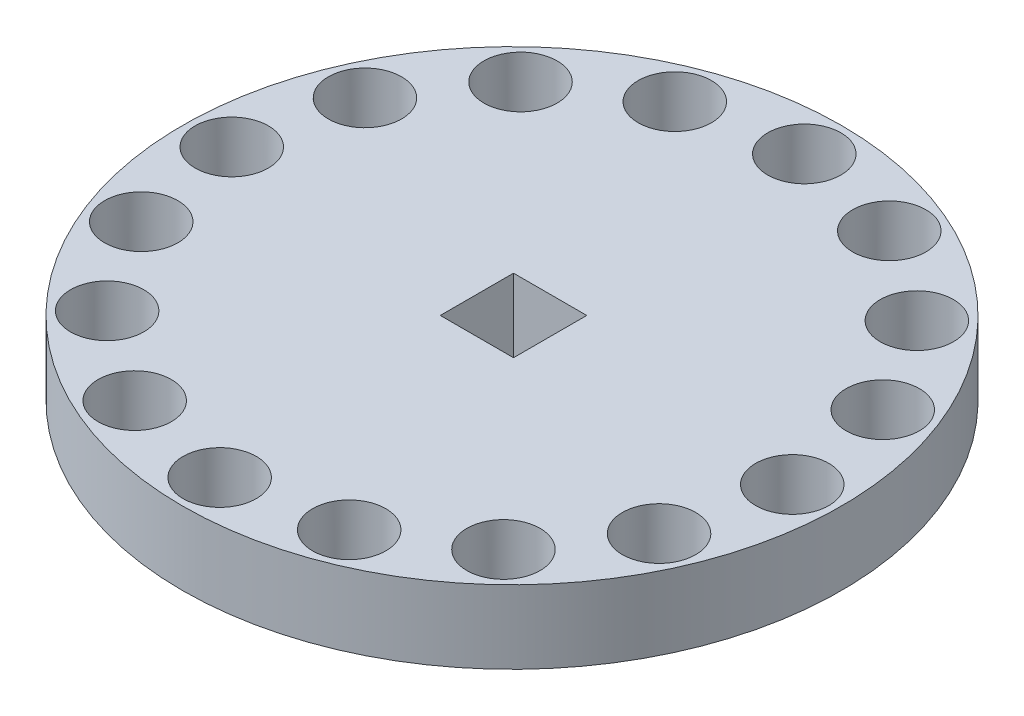
ISO-10303-21;
HEADER;
FILE_DESCRIPTION(('STEP AP214'),'2;1');
FILE_NAME('part.step','',(''),(''),'','','');
FILE_SCHEMA(('AUTOMOTIVE_DESIGN { 1 0 10303 214 1 1 1 1 }'));
ENDSEC;
DATA;
#1=APPLICATION_CONTEXT('core data for automotive mechanical design processes');
#2=APPLICATION_PROTOCOL_DEFINITION('international standard','automotive_design',2000,#1);
#3=PRODUCT_CONTEXT('',#1,'mechanical');
#4=PRODUCT('Part','Part','',(#3));
#5=PRODUCT_RELATED_PRODUCT_CATEGORY('part','',(#4));
#6=PRODUCT_DEFINITION_FORMATION('','',#4);
#7=PRODUCT_DEFINITION_CONTEXT('part definition',#1,'design');
#8=PRODUCT_DEFINITION('design','',#6,#7);
#9=PRODUCT_DEFINITION_SHAPE('','',#8);
#10=(LENGTH_UNIT() NAMED_UNIT(*) SI_UNIT(.MILLI.,.METRE.));
#11=(NAMED_UNIT(*) PLANE_ANGLE_UNIT() SI_UNIT($,.RADIAN.));
#12=(NAMED_UNIT(*) SI_UNIT($,.STERADIAN.) SOLID_ANGLE_UNIT());
#13=UNCERTAINTY_MEASURE_WITH_UNIT(LENGTH_MEASURE(1.E-05),#10,'distance_accuracy_value','');
#14=(GEOMETRIC_REPRESENTATION_CONTEXT(3) GLOBAL_UNCERTAINTY_ASSIGNED_CONTEXT((#13)) GLOBAL_UNIT_ASSIGNED_CONTEXT((#10,
#11,#12)) REPRESENTATION_CONTEXT('',''));
#15=CARTESIAN_POINT('',(0.,0.,0.));
#16=DIRECTION('',(0.,0.,1.));
#17=DIRECTION('',(1.,0.,0.));
#18=AXIS2_PLACEMENT_3D('',#15,#16,#17);
#19=CARTESIAN_POINT('',(0.,2.,0.));
#20=DIRECTION('',(0.,-1.,0.));
#21=DIRECTION('',(0.,0.,-1.));
#22=AXIS2_PLACEMENT_3D('',#19,#20,#21);
#23=CYLINDRICAL_SURFACE('',#22,9.);
#24=CARTESIAN_POINT('',(0.,2.,0.));
#25=DIRECTION('',(0.,1.,0.));
#26=DIRECTION('',(0.,0.,1.));
#27=AXIS2_PLACEMENT_3D('',#24,#25,#26);
#28=CIRCLE('',#27,9.);
#29=CARTESIAN_POINT('',(0.,2.,9.));
#30=VERTEX_POINT('',#29);
#31=EDGE_CURVE('E118',#30,#30,#28,.T.);
#32=ORIENTED_EDGE('',*,*,#31,.F.);
#33=EDGE_LOOP('',(#32));
#34=FACE_BOUND('',#33,.T.);
#35=CARTESIAN_POINT('',(0.,0.,0.));
#36=DIRECTION('',(0.,1.,0.));
#37=DIRECTION('',(0.,0.,1.));
#38=AXIS2_PLACEMENT_3D('',#35,#36,#37);
#39=CIRCLE('',#38,9.);
#40=CARTESIAN_POINT('',(0.,0.,9.));
#41=VERTEX_POINT('',#40);
#42=EDGE_CURVE('E113',#41,#41,#39,.T.);
#43=ORIENTED_EDGE('',*,*,#42,.T.);
#44=EDGE_LOOP('',(#43));
#45=FACE_BOUND('',#44,.T.);
#46=ADVANCED_FACE('F39',(#34,#45),#23,.T.);
#47=CARTESIAN_POINT('',(0.,2.,0.));
#48=DIRECTION('',(0.,1.,0.));
#49=DIRECTION('',(0.,0.,1.));
#50=AXIS2_PLACEMENT_3D('',#47,#48,#49);
#51=PLANE('',#50);
#52=CARTESIAN_POINT('',(5.41167169395816,2.,5.64458181266345));
#53=DIRECTION('',(0.,1.,0.));
#54=DIRECTION('',(-0.707106781186549,0.,0.707106781186546));
#55=AXIS2_PLACEMENT_3D('',#52,#53,#54);
#56=CIRCLE('',#55,1.);
#57=CARTESIAN_POINT('',(4.7045649127716,2.,6.35168859385));
#58=VERTEX_POINT('',#57);
#59=EDGE_CURVE('E209',#58,#58,#56,.T.);
#60=ORIENTED_EDGE('',*,*,#59,.F.);
#61=EDGE_LOOP('',(#60));
#62=FACE_BOUND('',#61,.T.);
#63=CARTESIAN_POINT('',(2.83964477238301,2.,7.28587070498213));
#64=DIRECTION('',(0.,1.,0.));
#65=DIRECTION('',(-0.923879532511288,0.,0.382683432365087));
#66=AXIS2_PLACEMENT_3D('',#63,#64,#65);
#67=CIRCLE('',#66,1.);
#68=CARTESIAN_POINT('',(1.91576523987172,2.,7.66855413734721));
#69=VERTEX_POINT('',#68);
#70=EDGE_CURVE('E235',#69,#69,#67,.T.);
#71=ORIENTED_EDGE('',*,*,#70,.F.);
#72=EDGE_LOOP('',(#71));
#73=FACE_BOUND('',#72,.T.);
#74=CARTESIAN_POINT('',(-0.16469232434349,2.,7.81795182904968));
#75=DIRECTION('',(0.,1.,0.));
#76=DIRECTION('',(-1.,0.,0.));
#77=AXIS2_PLACEMENT_3D('',#74,#75,#76);
#78=CIRCLE('',#77,1.);
#79=CARTESIAN_POINT('',(-1.16469232434349,2.,7.81795182904968));
#80=VERTEX_POINT('',#79);
#81=EDGE_CURVE('E231',#80,#80,#78,.T.);
#82=ORIENTED_EDGE('',*,*,#81,.F.);
#83=EDGE_LOOP('',(#82));
#84=FACE_BOUND('',#83,.T.);
#85=CARTESIAN_POINT('',(-3.14395650762833,2.,7.15982065705422));
#86=DIRECTION('',(0.,1.,0.));
#87=DIRECTION('',(-0.923879532511285,0.,-0.382683432365094));
#88=AXIS2_PLACEMENT_3D('',#85,#86,#87);
#89=CIRCLE('',#88,1.);
#90=CARTESIAN_POINT('',(-4.06783604013962,2.,6.77713722468913));
#91=VERTEX_POINT('',#90);
#92=EDGE_CURVE('E227',#91,#91,#89,.T.);
#93=ORIENTED_EDGE('',*,*,#92,.F.);
#94=EDGE_LOOP('',(#93));
#95=FACE_BOUND('',#94,.T.);
#96=CARTESIAN_POINT('',(-5.64458181266347,2.,5.41167169395813));
#97=DIRECTION('',(0.,1.,0.));
#98=DIRECTION('',(-0.707106781186544,0.,-0.707106781186551));
#99=AXIS2_PLACEMENT_3D('',#96,#97,#98);
#100=CIRCLE('',#99,1.);
#101=CARTESIAN_POINT('',(-6.35168859385001,2.,4.70456491277158));
#102=VERTEX_POINT('',#101);
#103=EDGE_CURVE('E223',#102,#102,#100,.T.);
#104=ORIENTED_EDGE('',*,*,#103,.F.);
#105=EDGE_LOOP('',(#104));
#106=FACE_BOUND('',#105,.T.);
#107=CARTESIAN_POINT('',(-7.28587070498213,2.,2.83964477238298));
#108=DIRECTION('',(0.,1.,0.));
#109=DIRECTION('',(-0.382683432365084,0.,-0.923879532511289));
#110=AXIS2_PLACEMENT_3D('',#107,#108,#109);
#111=CIRCLE('',#110,1.);
#112=CARTESIAN_POINT('',(-7.66855413734722,2.,1.91576523987169));
#113=VERTEX_POINT('',#112);
#114=EDGE_CURVE('E219',#113,#113,#111,.T.);
#115=ORIENTED_EDGE('',*,*,#114,.F.);
#116=EDGE_LOOP('',(#115));
#117=FACE_BOUND('',#116,.T.);
#118=CARTESIAN_POINT('',(-7.81795182904968,2.,-0.164692324343463));
#119=DIRECTION('',(0.,1.,0.));
#120=DIRECTION('',(0.,0.,-1.));
#121=AXIS2_PLACEMENT_3D('',#118,#119,#120);
#122=CIRCLE('',#121,1.);
#123=CARTESIAN_POINT('',(-7.81795182904968,2.,-1.16469232434346));
#124=VERTEX_POINT('',#123);
#125=EDGE_CURVE('E214',#124,#124,#122,.T.);
#126=ORIENTED_EDGE('',*,*,#125,.F.);
#127=EDGE_LOOP('',(#126));
#128=FACE_BOUND('',#127,.T.);
#129=CARTESIAN_POINT('',(-7.15982065705421,2.,-3.14395650762836));
#130=DIRECTION('',(0.,1.,0.));
#131=DIRECTION('',(0.382683432365097,0.,-0.923879532511284));
#132=AXIS2_PLACEMENT_3D('',#129,#130,#131);
#133=CIRCLE('',#132,1.);
#134=CARTESIAN_POINT('',(-6.77713722468911,2.,-4.06783604013964));
#135=VERTEX_POINT('',#134);
#136=EDGE_CURVE('E210',#135,#135,#133,.T.);
#137=ORIENTED_EDGE('',*,*,#136,.F.);
#138=EDGE_LOOP('',(#137));
#139=FACE_BOUND('',#138,.T.);
#140=CARTESIAN_POINT('',(-5.41167169395812,2.,-5.64458181266349));
#141=DIRECTION('',(0.,1.,0.));
#142=DIRECTION('',(0.707106781186554,0.,-0.707106781186541));
#143=AXIS2_PLACEMENT_3D('',#140,#141,#142);
#144=CIRCLE('',#143,1.);
#145=CARTESIAN_POINT('',(-4.70456491277156,2.,-6.35168859385003));
#146=VERTEX_POINT('',#145);
#147=EDGE_CURVE('E215',#146,#146,#144,.T.);
#148=ORIENTED_EDGE('',*,*,#147,.F.);
#149=EDGE_LOOP('',(#148));
#150=FACE_BOUND('',#149,.T.);
#151=CARTESIAN_POINT('',(-2.83964477238295,2.,-7.28587070498215));
#152=DIRECTION('',(0.,1.,0.));
#153=DIRECTION('',(0.923879532511291,0.,-0.382683432365081));
#154=AXIS2_PLACEMENT_3D('',#151,#152,#153);
#155=CIRCLE('',#154,1.);
#156=CARTESIAN_POINT('',(-1.91576523987166,2.,-7.66855413734723));
#157=VERTEX_POINT('',#156);
#158=EDGE_CURVE('E258',#157,#157,#155,.T.);
#159=ORIENTED_EDGE('',*,*,#158,.F.);
#160=EDGE_LOOP('',(#159));
#161=FACE_BOUND('',#160,.T.);
#162=CARTESIAN_POINT('',(0.164692324343545,2.,-7.81795182904968));
#163=DIRECTION('',(0.,1.,0.));
#164=DIRECTION('',(1.,0.,0.));
#165=AXIS2_PLACEMENT_3D('',#162,#163,#164);
#166=CIRCLE('',#165,1.);
#167=CARTESIAN_POINT('',(1.16469232434355,2.,-7.81795182904967));
#168=VERTEX_POINT('',#167);
#169=EDGE_CURVE('E254',#168,#168,#166,.T.);
#170=ORIENTED_EDGE('',*,*,#169,.F.);
#171=EDGE_LOOP('',(#170));
#172=FACE_BOUND('',#171,.T.);
#173=CARTESIAN_POINT('',(3.14395650762838,2.,-7.1598206570542));
#174=DIRECTION('',(0.,1.,0.));
#175=DIRECTION('',(0.923879532511283,0.,0.3826834323651));
#176=AXIS2_PLACEMENT_3D('',#173,#174,#175);
#177=CIRCLE('',#176,1.);
#178=CARTESIAN_POINT('',(4.06783604013966,2.,-6.7771372246891));
#179=VERTEX_POINT('',#178);
#180=EDGE_CURVE('E250',#179,#179,#177,.T.);
#181=ORIENTED_EDGE('',*,*,#180,.F.);
#182=EDGE_LOOP('',(#181));
#183=FACE_BOUND('',#182,.T.);
#184=CARTESIAN_POINT('',(5.6445818126635,2.,-5.4116716939581));
#185=DIRECTION('',(0.,1.,0.));
#186=DIRECTION('',(0.707106781186539,0.,0.707106781186556));
#187=AXIS2_PLACEMENT_3D('',#184,#185,#186);
#188=CIRCLE('',#187,1.);
#189=CARTESIAN_POINT('',(6.35168859385004,2.,-4.70456491277154));
#190=VERTEX_POINT('',#189);
#191=EDGE_CURVE('E246',#190,#190,#188,.T.);
#192=ORIENTED_EDGE('',*,*,#191,.F.);
#193=EDGE_LOOP('',(#192));
#194=FACE_BOUND('',#193,.T.);
#195=CARTESIAN_POINT('',(7.28587070498216,2.,-2.83964477238293));
#196=DIRECTION('',(0.,1.,0.));
#197=DIRECTION('',(0.382683432365077,0.,0.923879532511292));
#198=AXIS2_PLACEMENT_3D('',#195,#196,#197);
#199=CIRCLE('',#198,1.);
#200=CARTESIAN_POINT('',(7.66855413734723,2.,-1.91576523987164));
#201=VERTEX_POINT('',#200);
#202=EDGE_CURVE('E242',#201,#201,#199,.T.);
#203=ORIENTED_EDGE('',*,*,#202,.F.);
#204=EDGE_LOOP('',(#203));
#205=FACE_BOUND('',#204,.T.);
#206=CARTESIAN_POINT('',(7.15982065705423,2.,3.14395650762831));
#207=DIRECTION('',(0.,1.,0.));
#208=DIRECTION('',(-0.382683432365091,0.,0.923879532511287));
#209=AXIS2_PLACEMENT_3D('',#206,#207,#208);
#210=CIRCLE('',#209,1.);
#211=CARTESIAN_POINT('',(6.77713722468914,2.,4.06783604013959));
#212=VERTEX_POINT('',#211);
#213=EDGE_CURVE('E143',#212,#212,#210,.T.);
#214=ORIENTED_EDGE('',*,*,#213,.F.);
#215=EDGE_LOOP('',(#214));
#216=FACE_BOUND('',#215,.T.);
#217=CARTESIAN_POINT('',(7.81795182904968,2.,0.164692324343463));
#218=DIRECTION('',(0.,1.,0.));
#219=DIRECTION('',(0.,0.,1.));
#220=AXIS2_PLACEMENT_3D('',#217,#218,#219);
#221=CIRCLE('',#220,1.);
#222=CARTESIAN_POINT('',(7.81795182904968,2.,1.16469232434346));
#223=VERTEX_POINT('',#222);
#224=EDGE_CURVE('E137',#223,#223,#221,.T.);
#225=ORIENTED_EDGE('',*,*,#224,.F.);
#226=EDGE_LOOP('',(#225));
#227=FACE_BOUND('',#226,.T.);
#228=DIRECTION('',(0.,0.,-1.));
#229=VECTOR('',#228,1.);
#230=CARTESIAN_POINT('',(1.01420565881301,2.,-1.02735749943532));
#231=LINE('',#230,#229);
#232=CARTESIAN_POINT('',(1.01420565881301,2.,0.972642500564676));
#233=VERTEX_POINT('',#232);
#234=CARTESIAN_POINT('',(1.01420565881301,2.,-1.02735749943532));
#235=VERTEX_POINT('',#234);
#236=EDGE_CURVE('E56',#233,#235,#231,.T.);
#237=ORIENTED_EDGE('',*,*,#236,.F.);
#238=DIRECTION('',(1.,0.,0.));
#239=VECTOR('',#238,1.);
#240=CARTESIAN_POINT('',(1.01420565881301,2.,0.972642500564676));
#241=LINE('',#240,#239);
#242=CARTESIAN_POINT('',(-0.985794341186992,2.,0.972642500564676));
#243=VERTEX_POINT('',#242);
#244=EDGE_CURVE('E103',#243,#233,#241,.T.);
#245=ORIENTED_EDGE('',*,*,#244,.F.);
#246=DIRECTION('',(0.,0.,1.));
#247=VECTOR('',#246,1.);
#248=CARTESIAN_POINT('',(-0.985794341186995,2.,-1.02735749943532));
#249=LINE('',#248,#247);
#250=CARTESIAN_POINT('',(-0.985794341186995,2.,-1.02735749943532));
#251=VERTEX_POINT('',#250);
#252=EDGE_CURVE('E85',#251,#243,#249,.T.);
#253=ORIENTED_EDGE('',*,*,#252,.F.);
#254=DIRECTION('',(-1.,0.,0.));
#255=VECTOR('',#254,1.);
#256=CARTESIAN_POINT('',(1.01420565881301,2.,-1.02735749943532));
#257=LINE('',#256,#255);
#258=EDGE_CURVE('E95',#235,#251,#257,.T.);
#259=ORIENTED_EDGE('',*,*,#258,.F.);
#260=EDGE_LOOP('',(#237,#245,#253,#259));
#261=FACE_BOUND('',#260,.T.);
#262=ORIENTED_EDGE('',*,*,#31,.T.);
#263=EDGE_LOOP('',(#262));
#264=FACE_BOUND('',#263,.T.);
#265=ADVANCED_FACE('F100',(#62,#73,#84,#95,#106,#117,#128,#139,#150,#161,#172,#183,#194,#205,
#216,#227,#261,#264),#51,.T.);
#266=CARTESIAN_POINT('',(0.,0.,0.));
#267=DIRECTION('',(0.,1.,0.));
#268=DIRECTION('',(0.,0.,1.));
#269=AXIS2_PLACEMENT_3D('',#266,#267,#268);
#270=PLANE('',#269);
#271=CARTESIAN_POINT('',(5.41167169395816,0.,5.64458181266345));
#272=DIRECTION('',(0.,1.,0.));
#273=DIRECTION('',(0.,0.,1.));
#274=AXIS2_PLACEMENT_3D('',#271,#272,#273);
#275=CIRCLE('',#274,1.);
#276=CARTESIAN_POINT('',(5.41167169395816,0.,6.64458181266345));
#277=VERTEX_POINT('',#276);
#278=EDGE_CURVE('E42',#277,#277,#275,.T.);
#279=ORIENTED_EDGE('',*,*,#278,.T.);
#280=EDGE_LOOP('',(#279));
#281=FACE_BOUND('',#280,.T.);
#282=CARTESIAN_POINT('',(2.83964477238301,0.,7.28587070498213));
#283=DIRECTION('',(0.,1.,0.));
#284=DIRECTION('',(0.,0.,1.));
#285=AXIS2_PLACEMENT_3D('',#282,#283,#284);
#286=CIRCLE('',#285,1.);
#287=CARTESIAN_POINT('',(2.83964477238301,0.,8.28587070498213));
#288=VERTEX_POINT('',#287);
#289=EDGE_CURVE('E190',#288,#288,#286,.T.);
#290=ORIENTED_EDGE('',*,*,#289,.T.);
#291=EDGE_LOOP('',(#290));
#292=FACE_BOUND('',#291,.T.);
#293=CARTESIAN_POINT('',(-0.16469232434349,0.,7.81795182904968));
#294=DIRECTION('',(0.,1.,0.));
#295=DIRECTION('',(0.,0.,1.));
#296=AXIS2_PLACEMENT_3D('',#293,#294,#295);
#297=CIRCLE('',#296,1.);
#298=CARTESIAN_POINT('',(-0.16469232434349,0.,8.81795182904968));
#299=VERTEX_POINT('',#298);
#300=EDGE_CURVE('E187',#299,#299,#297,.T.);
#301=ORIENTED_EDGE('',*,*,#300,.T.);
#302=EDGE_LOOP('',(#301));
#303=FACE_BOUND('',#302,.T.);
#304=CARTESIAN_POINT('',(-3.14395650762833,0.,7.15982065705422));
#305=DIRECTION('',(0.,1.,0.));
#306=DIRECTION('',(0.,0.,1.));
#307=AXIS2_PLACEMENT_3D('',#304,#305,#306);
#308=CIRCLE('',#307,1.);
#309=CARTESIAN_POINT('',(-3.14395650762833,0.,8.15982065705423));
#310=VERTEX_POINT('',#309);
#311=EDGE_CURVE('E183',#310,#310,#308,.T.);
#312=ORIENTED_EDGE('',*,*,#311,.T.);
#313=EDGE_LOOP('',(#312));
#314=FACE_BOUND('',#313,.T.);
#315=CARTESIAN_POINT('',(-5.64458181266347,0.,5.41167169395813));
#316=DIRECTION('',(0.,1.,0.));
#317=DIRECTION('',(0.,0.,1.));
#318=AXIS2_PLACEMENT_3D('',#315,#316,#317);
#319=CIRCLE('',#318,1.);
#320=CARTESIAN_POINT('',(-5.64458181266347,0.,6.41167169395814));
#321=VERTEX_POINT('',#320);
#322=EDGE_CURVE('E179',#321,#321,#319,.T.);
#323=ORIENTED_EDGE('',*,*,#322,.T.);
#324=EDGE_LOOP('',(#323));
#325=FACE_BOUND('',#324,.T.);
#326=CARTESIAN_POINT('',(-7.28587070498213,0.,2.83964477238298));
#327=DIRECTION('',(0.,1.,0.));
#328=DIRECTION('',(0.,0.,1.));
#329=AXIS2_PLACEMENT_3D('',#326,#327,#328);
#330=CIRCLE('',#329,1.);
#331=CARTESIAN_POINT('',(-7.28587070498213,0.,3.83964477238298));
#332=VERTEX_POINT('',#331);
#333=EDGE_CURVE('E175',#332,#332,#330,.T.);
#334=ORIENTED_EDGE('',*,*,#333,.T.);
#335=EDGE_LOOP('',(#334));
#336=FACE_BOUND('',#335,.T.);
#337=CARTESIAN_POINT('',(-7.81795182904968,0.,-0.164692324343463));
#338=DIRECTION('',(0.,1.,0.));
#339=DIRECTION('',(0.,0.,1.));
#340=AXIS2_PLACEMENT_3D('',#337,#338,#339);
#341=CIRCLE('',#340,1.);
#342=CARTESIAN_POINT('',(-7.81795182904968,0.,0.835307675656539));
#343=VERTEX_POINT('',#342);
#344=EDGE_CURVE('E171',#343,#343,#341,.T.);
#345=ORIENTED_EDGE('',*,*,#344,.T.);
#346=EDGE_LOOP('',(#345));
#347=FACE_BOUND('',#346,.T.);
#348=CARTESIAN_POINT('',(-7.15982065705421,0.,-3.14395650762836));
#349=DIRECTION('',(0.,1.,0.));
#350=DIRECTION('',(0.,0.,1.));
#351=AXIS2_PLACEMENT_3D('',#348,#349,#350);
#352=CIRCLE('',#351,1.);
#353=CARTESIAN_POINT('',(-7.15982065705421,0.,-2.14395650762835));
#354=VERTEX_POINT('',#353);
#355=EDGE_CURVE('E167',#354,#354,#352,.T.);
#356=ORIENTED_EDGE('',*,*,#355,.T.);
#357=EDGE_LOOP('',(#356));
#358=FACE_BOUND('',#357,.T.);
#359=CARTESIAN_POINT('',(-5.41167169395812,0.,-5.64458181266349));
#360=DIRECTION('',(0.,1.,0.));
#361=DIRECTION('',(0.,0.,1.));
#362=AXIS2_PLACEMENT_3D('',#359,#360,#361);
#363=CIRCLE('',#362,1.);
#364=CARTESIAN_POINT('',(-5.41167169395812,0.,-4.64458181266348));
#365=VERTEX_POINT('',#364);
#366=EDGE_CURVE('E163',#365,#365,#363,.T.);
#367=ORIENTED_EDGE('',*,*,#366,.T.);
#368=EDGE_LOOP('',(#367));
#369=FACE_BOUND('',#368,.T.);
#370=CARTESIAN_POINT('',(-2.83964477238295,0.,-7.28587070498215));
#371=DIRECTION('',(0.,1.,0.));
#372=DIRECTION('',(0.,0.,1.));
#373=AXIS2_PLACEMENT_3D('',#370,#371,#372);
#374=CIRCLE('',#373,1.);
#375=CARTESIAN_POINT('',(-2.83964477238295,0.,-6.28587070498215));
#376=VERTEX_POINT('',#375);
#377=EDGE_CURVE('E159',#376,#376,#374,.T.);
#378=ORIENTED_EDGE('',*,*,#377,.T.);
#379=EDGE_LOOP('',(#378));
#380=FACE_BOUND('',#379,.T.);
#381=CARTESIAN_POINT('',(0.164692324343545,0.,-7.81795182904968));
#382=DIRECTION('',(0.,1.,0.));
#383=DIRECTION('',(0.,0.,1.));
#384=AXIS2_PLACEMENT_3D('',#381,#382,#383);
#385=CIRCLE('',#384,1.);
#386=CARTESIAN_POINT('',(0.164692324343545,0.,-6.81795182904968));
#387=VERTEX_POINT('',#386);
#388=EDGE_CURVE('E155',#387,#387,#385,.T.);
#389=ORIENTED_EDGE('',*,*,#388,.T.);
#390=EDGE_LOOP('',(#389));
#391=FACE_BOUND('',#390,.T.);
#392=CARTESIAN_POINT('',(3.14395650762838,0.,-7.1598206570542));
#393=DIRECTION('',(0.,1.,0.));
#394=DIRECTION('',(0.,0.,1.));
#395=AXIS2_PLACEMENT_3D('',#392,#393,#394);
#396=CIRCLE('',#395,1.);
#397=CARTESIAN_POINT('',(3.14395650762838,0.,-6.1598206570542));
#398=VERTEX_POINT('',#397);
#399=EDGE_CURVE('E151',#398,#398,#396,.T.);
#400=ORIENTED_EDGE('',*,*,#399,.T.);
#401=EDGE_LOOP('',(#400));
#402=FACE_BOUND('',#401,.T.);
#403=CARTESIAN_POINT('',(5.6445818126635,0.,-5.4116716939581));
#404=DIRECTION('',(0.,1.,0.));
#405=DIRECTION('',(0.,0.,1.));
#406=AXIS2_PLACEMENT_3D('',#403,#404,#405);
#407=CIRCLE('',#406,1.);
#408=CARTESIAN_POINT('',(5.6445818126635,0.,-4.41167169395809));
#409=VERTEX_POINT('',#408);
#410=EDGE_CURVE('E147',#409,#409,#407,.T.);
#411=ORIENTED_EDGE('',*,*,#410,.T.);
#412=EDGE_LOOP('',(#411));
#413=FACE_BOUND('',#412,.T.);
#414=CARTESIAN_POINT('',(7.28587070498216,0.,-2.83964477238293));
#415=DIRECTION('',(0.,1.,0.));
#416=DIRECTION('',(0.,0.,1.));
#417=AXIS2_PLACEMENT_3D('',#414,#415,#416);
#418=CIRCLE('',#417,1.);
#419=CARTESIAN_POINT('',(7.28587070498216,0.,-1.83964477238293));
#420=VERTEX_POINT('',#419);
#421=EDGE_CURVE('E142',#420,#420,#418,.T.);
#422=ORIENTED_EDGE('',*,*,#421,.T.);
#423=EDGE_LOOP('',(#422));
#424=FACE_BOUND('',#423,.T.);
#425=CARTESIAN_POINT('',(7.15982065705423,0.,3.14395650762831));
#426=DIRECTION('',(0.,1.,0.));
#427=DIRECTION('',(0.,0.,1.));
#428=AXIS2_PLACEMENT_3D('',#425,#426,#427);
#429=CIRCLE('',#428,1.);
#430=CARTESIAN_POINT('',(7.15982065705423,0.,4.14395650762831));
#431=VERTEX_POINT('',#430);
#432=EDGE_CURVE('E138',#431,#431,#429,.T.);
#433=ORIENTED_EDGE('',*,*,#432,.T.);
#434=EDGE_LOOP('',(#433));
#435=FACE_BOUND('',#434,.T.);
#436=CARTESIAN_POINT('',(7.81795182904968,0.,0.164692324343463));
#437=DIRECTION('',(0.,1.,0.));
#438=DIRECTION('',(0.,0.,1.));
#439=AXIS2_PLACEMENT_3D('',#436,#437,#438);
#440=CIRCLE('',#439,1.);
#441=CARTESIAN_POINT('',(7.81795182904968,0.,1.16469232434346));
#442=VERTEX_POINT('',#441);
#443=EDGE_CURVE('E133',#442,#442,#440,.T.);
#444=ORIENTED_EDGE('',*,*,#443,.T.);
#445=EDGE_LOOP('',(#444));
#446=FACE_BOUND('',#445,.T.);
#447=DIRECTION('',(1.,0.,0.));
#448=VECTOR('',#447,1.);
#449=CARTESIAN_POINT('',(0.,0.,0.972642500564676));
#450=LINE('',#449,#448);
#451=CARTESIAN_POINT('',(-0.985794341186992,0.,0.972642500564676));
#452=VERTEX_POINT('',#451);
#453=CARTESIAN_POINT('',(1.01420565881301,0.,0.972642500564676));
#454=VERTEX_POINT('',#453);
#455=EDGE_CURVE('E48',#452,#454,#450,.T.);
#456=ORIENTED_EDGE('',*,*,#455,.T.);
#457=DIRECTION('',(0.,0.,-1.));
#458=VECTOR('',#457,1.);
#459=CARTESIAN_POINT('',(1.01420565881301,0.,0.));
#460=LINE('',#459,#458);
#461=CARTESIAN_POINT('',(1.01420565881301,0.,-1.02735749943532));
#462=VERTEX_POINT('',#461);
#463=EDGE_CURVE('E11',#454,#462,#460,.T.);
#464=ORIENTED_EDGE('',*,*,#463,.T.);
#465=DIRECTION('',(-1.,0.,0.));
#466=VECTOR('',#465,1.);
#467=CARTESIAN_POINT('',(0.,0.,-1.02735749943532));
#468=LINE('',#467,#466);
#469=CARTESIAN_POINT('',(-0.985794341186995,0.,-1.02735749943532));
#470=VERTEX_POINT('',#469);
#471=EDGE_CURVE('E122',#462,#470,#468,.T.);
#472=ORIENTED_EDGE('',*,*,#471,.T.);
#473=DIRECTION('',(0.,0.,1.));
#474=VECTOR('',#473,1.);
#475=CARTESIAN_POINT('',(-0.985794341186994,0.,0.));
#476=LINE('',#475,#474);
#477=EDGE_CURVE('E88',#470,#452,#476,.T.);
#478=ORIENTED_EDGE('',*,*,#477,.T.);
#479=EDGE_LOOP('',(#456,#464,#472,#478));
#480=FACE_BOUND('',#479,.T.);
#481=ORIENTED_EDGE('',*,*,#42,.F.);
#482=EDGE_LOOP('',(#481));
#483=FACE_BOUND('',#482,.T.);
#484=ADVANCED_FACE('F271',(#281,#292,#303,#314,#325,#336,#347,#358,#369,#380,#391,#402,#413,
#424,#435,#446,#480,#483),#270,.F.);
#485=CARTESIAN_POINT('',(1.01420565881301,-1.,-1.02735749943532));
#486=DIRECTION('',(1.,0.,0.));
#487=DIRECTION('',(0.,0.,-1.));
#488=AXIS2_PLACEMENT_3D('',#485,#486,#487);
#489=PLANE('',#488);
#490=DIRECTION('',(0.,1.,0.));
#491=VECTOR('',#490,1.);
#492=CARTESIAN_POINT('',(1.01420565881301,-1.,0.972642500564676));
#493=LINE('',#492,#491);
#494=EDGE_CURVE('E110',#454,#233,#493,.T.);
#495=ORIENTED_EDGE('',*,*,#494,.T.);
#496=ORIENTED_EDGE('',*,*,#236,.T.);
#497=DIRECTION('',(0.,1.,0.));
#498=VECTOR('',#497,1.);
#499=CARTESIAN_POINT('',(1.01420565881301,-1.,-1.02735749943532));
#500=LINE('',#499,#498);
#501=EDGE_CURVE('E92',#462,#235,#500,.T.);
#502=ORIENTED_EDGE('',*,*,#501,.F.);
#503=ORIENTED_EDGE('',*,*,#463,.F.);
#504=EDGE_LOOP('',(#495,#496,#502,#503));
#505=FACE_BOUND('',#504,.T.);
#506=ADVANCED_FACE('F297',(#505),#489,.F.);
#507=CARTESIAN_POINT('',(1.01420565881301,-1.,0.972642500564676));
#508=DIRECTION('',(0.,0.,1.));
#509=DIRECTION('',(1.,0.,0.));
#510=AXIS2_PLACEMENT_3D('',#507,#508,#509);
#511=PLANE('',#510);
#512=DIRECTION('',(0.,1.,0.));
#513=VECTOR('',#512,1.);
#514=CARTESIAN_POINT('',(-0.985794341186992,-1.,0.972642500564676));
#515=LINE('',#514,#513);
#516=EDGE_CURVE('E91',#452,#243,#515,.T.);
#517=ORIENTED_EDGE('',*,*,#516,.T.);
#518=ORIENTED_EDGE('',*,*,#244,.T.);
#519=ORIENTED_EDGE('',*,*,#494,.F.);
#520=ORIENTED_EDGE('',*,*,#455,.F.);
#521=EDGE_LOOP('',(#517,#518,#519,#520));
#522=FACE_BOUND('',#521,.T.);
#523=ADVANCED_FACE('F324',(#522),#511,.F.);
#524=CARTESIAN_POINT('',(-0.985794341186995,-1.,-1.02735749943532));
#525=DIRECTION('',(-1.,0.,0.));
#526=DIRECTION('',(0.,0.,1.));
#527=AXIS2_PLACEMENT_3D('',#524,#525,#526);
#528=PLANE('',#527);
#529=DIRECTION('',(0.,1.,0.));
#530=VECTOR('',#529,1.);
#531=CARTESIAN_POINT('',(-0.985794341186995,-1.,-1.02735749943532));
#532=LINE('',#531,#530);
#533=EDGE_CURVE('E64',#470,#251,#532,.T.);
#534=ORIENTED_EDGE('',*,*,#533,.T.);
#535=ORIENTED_EDGE('',*,*,#252,.T.);
#536=ORIENTED_EDGE('',*,*,#516,.F.);
#537=ORIENTED_EDGE('',*,*,#477,.F.);
#538=EDGE_LOOP('',(#534,#535,#536,#537));
#539=FACE_BOUND('',#538,.T.);
#540=ADVANCED_FACE('F82',(#539),#528,.F.);
#541=CARTESIAN_POINT('',(1.01420565881301,-1.,-1.02735749943532));
#542=DIRECTION('',(0.,0.,-1.));
#543=DIRECTION('',(-1.,0.,0.));
#544=AXIS2_PLACEMENT_3D('',#541,#542,#543);
#545=PLANE('',#544);
#546=ORIENTED_EDGE('',*,*,#501,.T.);
#547=ORIENTED_EDGE('',*,*,#258,.T.);
#548=ORIENTED_EDGE('',*,*,#533,.F.);
#549=ORIENTED_EDGE('',*,*,#471,.F.);
#550=EDGE_LOOP('',(#546,#547,#548,#549));
#551=FACE_BOUND('',#550,.T.);
#552=ADVANCED_FACE('F96',(#551),#545,.F.);
#553=CARTESIAN_POINT('',(7.81795182904968,-1.,0.164692324343463));
#554=DIRECTION('',(0.,1.,0.));
#555=DIRECTION('',(0.,0.,1.));
#556=AXIS2_PLACEMENT_3D('',#553,#554,#555);
#557=CYLINDRICAL_SURFACE('',#556,1.);
#558=ORIENTED_EDGE('',*,*,#224,.T.);
#559=EDGE_LOOP('',(#558));
#560=FACE_BOUND('',#559,.T.);
#561=ORIENTED_EDGE('',*,*,#443,.F.);
#562=EDGE_LOOP('',(#561));
#563=FACE_BOUND('',#562,.T.);
#564=ADVANCED_FACE('F291',(#560,#563),#557,.F.);
#565=CARTESIAN_POINT('',(7.15982065705423,-1.,3.14395650762831));
#566=DIRECTION('',(0.,1.,0.));
#567=DIRECTION('',(0.,0.,1.));
#568=AXIS2_PLACEMENT_3D('',#565,#566,#567);
#569=CYLINDRICAL_SURFACE('',#568,1.);
#570=ORIENTED_EDGE('',*,*,#213,.T.);
#571=EDGE_LOOP('',(#570));
#572=FACE_BOUND('',#571,.T.);
#573=ORIENTED_EDGE('',*,*,#432,.F.);
#574=EDGE_LOOP('',(#573));
#575=FACE_BOUND('',#574,.T.);
#576=ADVANCED_FACE('F287',(#572,#575),#569,.F.);
#577=CARTESIAN_POINT('',(7.28587070498216,-1.,-2.83964477238293));
#578=DIRECTION('',(0.,1.,0.));
#579=DIRECTION('',(0.,0.,1.));
#580=AXIS2_PLACEMENT_3D('',#577,#578,#579);
#581=CYLINDRICAL_SURFACE('',#580,1.);
#582=ORIENTED_EDGE('',*,*,#202,.T.);
#583=EDGE_LOOP('',(#582));
#584=FACE_BOUND('',#583,.T.);
#585=ORIENTED_EDGE('',*,*,#421,.F.);
#586=EDGE_LOOP('',(#585));
#587=FACE_BOUND('',#586,.T.);
#588=ADVANCED_FACE('F290',(#584,#587),#581,.F.);
#589=CARTESIAN_POINT('',(5.6445818126635,-1.,-5.4116716939581));
#590=DIRECTION('',(0.,1.,0.));
#591=DIRECTION('',(0.,0.,1.));
#592=AXIS2_PLACEMENT_3D('',#589,#590,#591);
#593=CYLINDRICAL_SURFACE('',#592,1.);
#594=ORIENTED_EDGE('',*,*,#191,.T.);
#595=EDGE_LOOP('',(#594));
#596=FACE_BOUND('',#595,.T.);
#597=ORIENTED_EDGE('',*,*,#410,.F.);
#598=EDGE_LOOP('',(#597));
#599=FACE_BOUND('',#598,.T.);
#600=ADVANCED_FACE('F358',(#596,#599),#593,.F.);
#601=CARTESIAN_POINT('',(3.14395650762838,-1.,-7.1598206570542));
#602=DIRECTION('',(0.,1.,0.));
#603=DIRECTION('',(0.,0.,1.));
#604=AXIS2_PLACEMENT_3D('',#601,#602,#603);
#605=CYLINDRICAL_SURFACE('',#604,1.);
#606=ORIENTED_EDGE('',*,*,#180,.T.);
#607=EDGE_LOOP('',(#606));
#608=FACE_BOUND('',#607,.T.);
#609=ORIENTED_EDGE('',*,*,#399,.F.);
#610=EDGE_LOOP('',(#609));
#611=FACE_BOUND('',#610,.T.);
#612=ADVANCED_FACE('F366',(#608,#611),#605,.F.);
#613=CARTESIAN_POINT('',(0.164692324343545,-1.,-7.81795182904968));
#614=DIRECTION('',(0.,1.,0.));
#615=DIRECTION('',(0.,0.,1.));
#616=AXIS2_PLACEMENT_3D('',#613,#614,#615);
#617=CYLINDRICAL_SURFACE('',#616,1.);
#618=ORIENTED_EDGE('',*,*,#169,.T.);
#619=EDGE_LOOP('',(#618));
#620=FACE_BOUND('',#619,.T.);
#621=ORIENTED_EDGE('',*,*,#388,.F.);
#622=EDGE_LOOP('',(#621));
#623=FACE_BOUND('',#622,.T.);
#624=ADVANCED_FACE('F374',(#620,#623),#617,.F.);
#625=CARTESIAN_POINT('',(-2.83964477238295,-1.,-7.28587070498215));
#626=DIRECTION('',(0.,1.,0.));
#627=DIRECTION('',(0.,0.,1.));
#628=AXIS2_PLACEMENT_3D('',#625,#626,#627);
#629=CYLINDRICAL_SURFACE('',#628,1.);
#630=ORIENTED_EDGE('',*,*,#158,.T.);
#631=EDGE_LOOP('',(#630));
#632=FACE_BOUND('',#631,.T.);
#633=ORIENTED_EDGE('',*,*,#377,.F.);
#634=EDGE_LOOP('',(#633));
#635=FACE_BOUND('',#634,.T.);
#636=ADVANCED_FACE('F382',(#632,#635),#629,.F.);
#637=CARTESIAN_POINT('',(-5.41167169395812,-1.,-5.64458181266349));
#638=DIRECTION('',(0.,1.,0.));
#639=DIRECTION('',(0.,0.,1.));
#640=AXIS2_PLACEMENT_3D('',#637,#638,#639);
#641=CYLINDRICAL_SURFACE('',#640,1.);
#642=ORIENTED_EDGE('',*,*,#147,.T.);
#643=EDGE_LOOP('',(#642));
#644=FACE_BOUND('',#643,.T.);
#645=ORIENTED_EDGE('',*,*,#366,.F.);
#646=EDGE_LOOP('',(#645));
#647=FACE_BOUND('',#646,.T.);
#648=ADVANCED_FACE('F266',(#644,#647),#641,.F.);
#649=CARTESIAN_POINT('',(-7.15982065705421,-1.,-3.14395650762836));
#650=DIRECTION('',(0.,1.,0.));
#651=DIRECTION('',(0.,0.,1.));
#652=AXIS2_PLACEMENT_3D('',#649,#650,#651);
#653=CYLINDRICAL_SURFACE('',#652,1.);
#654=ORIENTED_EDGE('',*,*,#136,.T.);
#655=EDGE_LOOP('',(#654));
#656=FACE_BOUND('',#655,.T.);
#657=ORIENTED_EDGE('',*,*,#355,.F.);
#658=EDGE_LOOP('',(#657));
#659=FACE_BOUND('',#658,.T.);
#660=ADVANCED_FACE('F397',(#656,#659),#653,.F.);
#661=CARTESIAN_POINT('',(-7.81795182904968,-1.,-0.164692324343463));
#662=DIRECTION('',(0.,1.,0.));
#663=DIRECTION('',(0.,0.,1.));
#664=AXIS2_PLACEMENT_3D('',#661,#662,#663);
#665=CYLINDRICAL_SURFACE('',#664,1.);
#666=ORIENTED_EDGE('',*,*,#125,.T.);
#667=EDGE_LOOP('',(#666));
#668=FACE_BOUND('',#667,.T.);
#669=ORIENTED_EDGE('',*,*,#344,.F.);
#670=EDGE_LOOP('',(#669));
#671=FACE_BOUND('',#670,.T.);
#672=ADVANCED_FACE('F404',(#668,#671),#665,.F.);
#673=CARTESIAN_POINT('',(-7.28587070498213,-1.,2.83964477238298));
#674=DIRECTION('',(0.,1.,0.));
#675=DIRECTION('',(0.,0.,1.));
#676=AXIS2_PLACEMENT_3D('',#673,#674,#675);
#677=CYLINDRICAL_SURFACE('',#676,1.);
#678=ORIENTED_EDGE('',*,*,#114,.T.);
#679=EDGE_LOOP('',(#678));
#680=FACE_BOUND('',#679,.T.);
#681=ORIENTED_EDGE('',*,*,#333,.F.);
#682=EDGE_LOOP('',(#681));
#683=FACE_BOUND('',#682,.T.);
#684=ADVANCED_FACE('F412',(#680,#683),#677,.F.);
#685=CARTESIAN_POINT('',(-5.64458181266347,-1.,5.41167169395813));
#686=DIRECTION('',(0.,1.,0.));
#687=DIRECTION('',(0.,0.,1.));
#688=AXIS2_PLACEMENT_3D('',#685,#686,#687);
#689=CYLINDRICAL_SURFACE('',#688,1.);
#690=ORIENTED_EDGE('',*,*,#103,.T.);
#691=EDGE_LOOP('',(#690));
#692=FACE_BOUND('',#691,.T.);
#693=ORIENTED_EDGE('',*,*,#322,.F.);
#694=EDGE_LOOP('',(#693));
#695=FACE_BOUND('',#694,.T.);
#696=ADVANCED_FACE('F420',(#692,#695),#689,.F.);
#697=CARTESIAN_POINT('',(-3.14395650762833,-1.,7.15982065705422));
#698=DIRECTION('',(0.,1.,0.));
#699=DIRECTION('',(0.,0.,1.));
#700=AXIS2_PLACEMENT_3D('',#697,#698,#699);
#701=CYLINDRICAL_SURFACE('',#700,1.);
#702=ORIENTED_EDGE('',*,*,#92,.T.);
#703=EDGE_LOOP('',(#702));
#704=FACE_BOUND('',#703,.T.);
#705=ORIENTED_EDGE('',*,*,#311,.F.);
#706=EDGE_LOOP('',(#705));
#707=FACE_BOUND('',#706,.T.);
#708=ADVANCED_FACE('F428',(#704,#707),#701,.F.);
#709=CARTESIAN_POINT('',(-0.16469232434349,-1.,7.81795182904968));
#710=DIRECTION('',(0.,1.,0.));
#711=DIRECTION('',(0.,0.,1.));
#712=AXIS2_PLACEMENT_3D('',#709,#710,#711);
#713=CYLINDRICAL_SURFACE('',#712,1.);
#714=ORIENTED_EDGE('',*,*,#81,.T.);
#715=EDGE_LOOP('',(#714));
#716=FACE_BOUND('',#715,.T.);
#717=ORIENTED_EDGE('',*,*,#300,.F.);
#718=EDGE_LOOP('',(#717));
#719=FACE_BOUND('',#718,.T.);
#720=ADVANCED_FACE('F436',(#716,#719),#713,.F.);
#721=CARTESIAN_POINT('',(2.83964477238301,-1.,7.28587070498213));
#722=DIRECTION('',(0.,1.,0.));
#723=DIRECTION('',(0.,0.,1.));
#724=AXIS2_PLACEMENT_3D('',#721,#722,#723);
#725=CYLINDRICAL_SURFACE('',#724,1.);
#726=ORIENTED_EDGE('',*,*,#70,.T.);
#727=EDGE_LOOP('',(#726));
#728=FACE_BOUND('',#727,.T.);
#729=ORIENTED_EDGE('',*,*,#289,.F.);
#730=EDGE_LOOP('',(#729));
#731=FACE_BOUND('',#730,.T.);
#732=ADVANCED_FACE('F444',(#728,#731),#725,.F.);
#733=CARTESIAN_POINT('',(5.41167169395816,-1.,5.64458181266345));
#734=DIRECTION('',(0.,1.,0.));
#735=DIRECTION('',(0.,0.,1.));
#736=AXIS2_PLACEMENT_3D('',#733,#734,#735);
#737=CYLINDRICAL_SURFACE('',#736,1.);
#738=ORIENTED_EDGE('',*,*,#59,.T.);
#739=EDGE_LOOP('',(#738));
#740=FACE_BOUND('',#739,.T.);
#741=ORIENTED_EDGE('',*,*,#278,.F.);
#742=EDGE_LOOP('',(#741));
#743=FACE_BOUND('',#742,.T.);
#744=ADVANCED_FACE('F452',(#740,#743),#737,.F.);
#745=CLOSED_SHELL('',(#46,#265,#484,#506,#523,#540,#552,#564,#576,#588,#600,#612,#624,#636,#648,
#660,#672,#684,#696,#708,#720,#732,#744));
#746=MANIFOLD_SOLID_BREP('B2',#745);
#747=ADVANCED_BREP_SHAPE_REPRESENTATION('',(#18,#746),#14);
#748=SHAPE_DEFINITION_REPRESENTATION(#9,#747);
ENDSEC;
END-ISO-10303-21;
